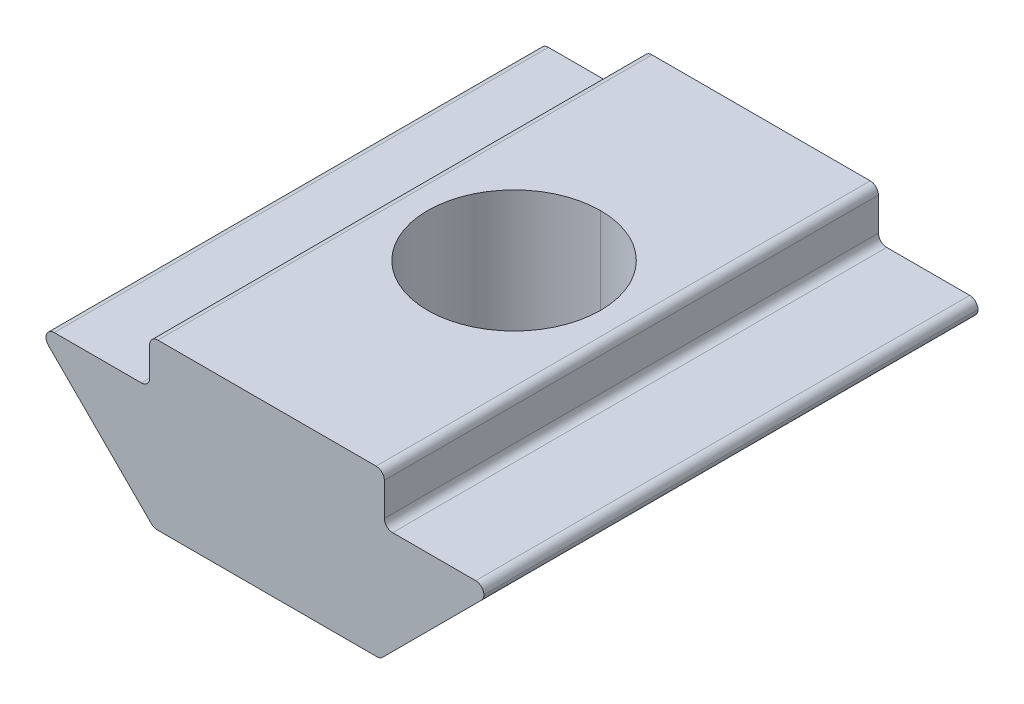
ISO-10303-21;
HEADER;
FILE_DESCRIPTION(('STEP AP214'),'2;1');
FILE_NAME('part.step','',(''),(''),'','','');
FILE_SCHEMA(('AUTOMOTIVE_DESIGN { 1 0 10303 214 1 1 1 1 }'));
ENDSEC;
DATA;
#1=APPLICATION_CONTEXT('core data for automotive mechanical design processes');
#2=APPLICATION_PROTOCOL_DEFINITION('international standard','automotive_design',2000,#1);
#3=PRODUCT_CONTEXT('',#1,'mechanical');
#4=PRODUCT('Part','Part','',(#3));
#5=PRODUCT_RELATED_PRODUCT_CATEGORY('part','',(#4));
#6=PRODUCT_DEFINITION_FORMATION('','',#4);
#7=PRODUCT_DEFINITION_CONTEXT('part definition',#1,'design');
#8=PRODUCT_DEFINITION('design','',#6,#7);
#9=PRODUCT_DEFINITION_SHAPE('','',#8);
#10=(LENGTH_UNIT() NAMED_UNIT(*) SI_UNIT(.MILLI.,.METRE.));
#11=(NAMED_UNIT(*) PLANE_ANGLE_UNIT() SI_UNIT($,.RADIAN.));
#12=(NAMED_UNIT(*) SI_UNIT($,.STERADIAN.) SOLID_ANGLE_UNIT());
#13=UNCERTAINTY_MEASURE_WITH_UNIT(LENGTH_MEASURE(1.E-05),#10,'distance_accuracy_value','');
#14=(GEOMETRIC_REPRESENTATION_CONTEXT(3) GLOBAL_UNCERTAINTY_ASSIGNED_CONTEXT((#13)) GLOBAL_UNIT_ASSIGNED_CONTEXT((#10,
#11,#12)) REPRESENTATION_CONTEXT('',''));
#15=CARTESIAN_POINT('',(0.,0.,0.));
#16=DIRECTION('',(0.,0.,1.));
#17=DIRECTION('',(1.,0.,0.));
#18=AXIS2_PLACEMENT_3D('',#15,#16,#17);
#19=CARTESIAN_POINT('',(1.90000000000005,3.00000000000005,20.));
#20=DIRECTION('',(0.,0.,1.));
#21=DIRECTION('',(1.,0.,0.));
#22=AXIS2_PLACEMENT_3D('',#19,#20,#21);
#23=CYLINDRICAL_SURFACE('',#22,0.2);
#24=CARTESIAN_POINT('',(1.90000000000005,3.00000000000005,20.));
#25=DIRECTION('',(0.,0.,-1.));
#26=DIRECTION('',(1.,0.,0.));
#27=AXIS2_PLACEMENT_3D('',#24,#25,#26);
#28=CIRCLE('',#27,0.2);
#29=CARTESIAN_POINT('',(1.90000000000005,2.80000000000005,20.));
#30=VERTEX_POINT('',#29);
#31=CARTESIAN_POINT('',(1.70000000000005,3.00000000000005,20.));
#32=VERTEX_POINT('',#31);
#33=EDGE_CURVE('E276',#30,#32,#28,.T.);
#34=ORIENTED_EDGE('',*,*,#33,.F.);
#35=DIRECTION('',(0.,0.,1.));
#36=VECTOR('',#35,1.);
#37=CARTESIAN_POINT('',(1.90000000000005,2.80000000000005,20.));
#38=LINE('',#37,#36);
#39=CARTESIAN_POINT('',(1.90000000000005,2.80000000000005,8.));
#40=VERTEX_POINT('',#39);
#41=EDGE_CURVE('E280',#40,#30,#38,.T.);
#42=ORIENTED_EDGE('',*,*,#41,.F.);
#43=CARTESIAN_POINT('',(1.90000000000005,3.00000000000005,8.));
#44=DIRECTION('',(0.,0.,1.));
#45=DIRECTION('',(1.,0.,0.));
#46=AXIS2_PLACEMENT_3D('',#43,#44,#45);
#47=CIRCLE('',#46,0.2);
#48=CARTESIAN_POINT('',(1.70000000000005,3.00000000000005,8.));
#49=VERTEX_POINT('',#48);
#50=EDGE_CURVE('E249',#49,#40,#47,.T.);
#51=ORIENTED_EDGE('',*,*,#50,.F.);
#52=DIRECTION('',(0.,0.,-1.));
#53=VECTOR('',#52,1.);
#54=CARTESIAN_POINT('',(1.70000000000005,3.00000000000005,8.));
#55=LINE('',#54,#53);
#56=EDGE_CURVE('E281',#32,#49,#55,.T.);
#57=ORIENTED_EDGE('',*,*,#56,.F.);
#58=EDGE_LOOP('',(#34,#42,#51,#57));
#59=FACE_BOUND('',#58,.T.);
#60=ADVANCED_FACE('F16',(#59),#23,.F.);
#61=CARTESIAN_POINT('',(-4.19999999999995,3.10000000000005,20.));
#62=DIRECTION('',(0.,0.,1.));
#63=DIRECTION('',(1.,0.,0.));
#64=AXIS2_PLACEMENT_3D('',#61,#62,#63);
#65=CYLINDRICAL_SURFACE('',#64,0.2);
#66=CARTESIAN_POINT('',(-4.19999999999995,3.10000000000005,20.));
#67=DIRECTION('',(0.,0.,-1.));
#68=DIRECTION('',(1.,0.,0.));
#69=AXIS2_PLACEMENT_3D('',#66,#67,#68);
#70=CIRCLE('',#69,0.2);
#71=CARTESIAN_POINT('',(-3.99999999999995,3.10000000000005,20.));
#72=VERTEX_POINT('',#71);
#73=CARTESIAN_POINT('',(-4.19999999999995,2.90000000000005,20.));
#74=VERTEX_POINT('',#73);
#75=EDGE_CURVE('E289',#72,#74,#70,.T.);
#76=ORIENTED_EDGE('',*,*,#75,.F.);
#77=DIRECTION('',(0.,0.,1.));
#78=VECTOR('',#77,1.);
#79=CARTESIAN_POINT('',(-3.99999999999995,3.10000000000005,20.));
#80=LINE('',#79,#78);
#81=CARTESIAN_POINT('',(-3.99999999999995,3.10000000000005,8.));
#82=VERTEX_POINT('',#81);
#83=EDGE_CURVE('E11',#82,#72,#80,.T.);
#84=ORIENTED_EDGE('',*,*,#83,.F.);
#85=CARTESIAN_POINT('',(-4.19999999999995,3.10000000000005,8.));
#86=DIRECTION('',(0.,0.,1.));
#87=DIRECTION('',(1.,0.,0.));
#88=AXIS2_PLACEMENT_3D('',#85,#86,#87);
#89=CIRCLE('',#88,0.2);
#90=CARTESIAN_POINT('',(-4.19999999999995,2.90000000000005,8.));
#91=VERTEX_POINT('',#90);
#92=EDGE_CURVE('E331',#91,#82,#89,.T.);
#93=ORIENTED_EDGE('',*,*,#92,.F.);
#94=DIRECTION('',(0.,0.,-1.));
#95=VECTOR('',#94,1.);
#96=CARTESIAN_POINT('',(-4.19999999999995,2.90000000000005,8.));
#97=LINE('',#96,#95);
#98=EDGE_CURVE('E20',#74,#91,#97,.T.);
#99=ORIENTED_EDGE('',*,*,#98,.F.);
#100=EDGE_LOOP('',(#76,#84,#93,#99));
#101=FACE_BOUND('',#100,.T.);
#102=ADVANCED_FACE('F488',(#101),#65,.F.);
#103=CARTESIAN_POINT('',(-3.81715728752532,0.200000000000053,8.));
#104=DIRECTION('',(0.,0.,1.));
#105=DIRECTION('',(1.,0.,0.));
#106=AXIS2_PLACEMENT_3D('',#103,#104,#105);
#107=CYLINDRICAL_SURFACE('',#106,0.2);
#108=CARTESIAN_POINT('',(-3.81715728752532,0.200000000000053,8.));
#109=DIRECTION('',(0.,0.,-1.));
#110=DIRECTION('',(1.,0.,0.));
#111=AXIS2_PLACEMENT_3D('',#108,#109,#110);
#112=CIRCLE('',#111,0.2);
#113=CARTESIAN_POINT('',(-3.81715728752532,0.,8.));
#114=VERTEX_POINT('',#113);
#115=CARTESIAN_POINT('',(-3.95857864376263,0.0585786437627442,8.));
#116=VERTEX_POINT('',#115);
#117=EDGE_CURVE('E253',#114,#116,#112,.T.);
#118=ORIENTED_EDGE('',*,*,#117,.F.);
#119=DIRECTION('',(0.,0.,-1.));
#120=VECTOR('',#119,1.);
#121=CARTESIAN_POINT('',(-3.81715728752532,0.,8.));
#122=LINE('',#121,#120);
#123=CARTESIAN_POINT('',(-3.81715728752532,0.,20.));
#124=VERTEX_POINT('',#123);
#125=EDGE_CURVE('E246',#124,#114,#122,.T.);
#126=ORIENTED_EDGE('',*,*,#125,.F.);
#127=CARTESIAN_POINT('',(-3.81715728752532,0.200000000000053,20.));
#128=DIRECTION('',(0.,0.,1.));
#129=DIRECTION('',(1.,0.,0.));
#130=AXIS2_PLACEMENT_3D('',#127,#128,#129);
#131=CIRCLE('',#130,0.2);
#132=CARTESIAN_POINT('',(-3.95857864376263,0.0585786437627442,20.));
#133=VERTEX_POINT('',#132);
#134=EDGE_CURVE('E344',#133,#124,#131,.T.);
#135=ORIENTED_EDGE('',*,*,#134,.F.);
#136=DIRECTION('',(0.,0.,1.));
#137=VECTOR('',#136,1.);
#138=CARTESIAN_POINT('',(-3.95857864376263,0.0585786437627424,8.));
#139=LINE('',#138,#137);
#140=EDGE_CURVE('E219',#116,#133,#139,.T.);
#141=ORIENTED_EDGE('',*,*,#140,.F.);
#142=EDGE_LOOP('',(#118,#126,#135,#141));
#143=FACE_BOUND('',#142,.T.);
#144=ADVANCED_FACE('F493',(#143),#107,.T.);
#145=CARTESIAN_POINT('',(-3.79999999999994,3.8,20.));
#146=DIRECTION('',(0.,0.,1.));
#147=DIRECTION('',(1.,0.,0.));
#148=AXIS2_PLACEMENT_3D('',#145,#146,#147);
#149=CYLINDRICAL_SURFACE('',#148,0.2);
#150=CARTESIAN_POINT('',(-3.79999999999994,3.8,20.));
#151=DIRECTION('',(0.,0.,1.));
#152=DIRECTION('',(1.,0.,0.));
#153=AXIS2_PLACEMENT_3D('',#150,#151,#152);
#154=CIRCLE('',#153,0.2);
#155=CARTESIAN_POINT('',(-3.79999999999994,4.,20.));
#156=VERTEX_POINT('',#155);
#157=CARTESIAN_POINT('',(-3.99999999999995,3.8,20.));
#158=VERTEX_POINT('',#157);
#159=EDGE_CURVE('E290',#156,#158,#154,.T.);
#160=ORIENTED_EDGE('',*,*,#159,.F.);
#161=DIRECTION('',(0.,0.,1.));
#162=VECTOR('',#161,1.);
#163=CARTESIAN_POINT('',(-3.79999999999994,4.,20.));
#164=LINE('',#163,#162);
#165=CARTESIAN_POINT('',(-3.79999999999994,4.,8.));
#166=VERTEX_POINT('',#165);
#167=EDGE_CURVE('E208',#166,#156,#164,.T.);
#168=ORIENTED_EDGE('',*,*,#167,.F.);
#169=CARTESIAN_POINT('',(-3.79999999999994,3.8,8.));
#170=DIRECTION('',(0.,0.,-1.));
#171=DIRECTION('',(1.,0.,0.));
#172=AXIS2_PLACEMENT_3D('',#169,#170,#171);
#173=CIRCLE('',#172,0.2);
#174=CARTESIAN_POINT('',(-3.99999999999995,3.8,8.));
#175=VERTEX_POINT('',#174);
#176=EDGE_CURVE('E197',#175,#166,#173,.T.);
#177=ORIENTED_EDGE('',*,*,#176,.F.);
#178=DIRECTION('',(0.,0.,-1.));
#179=VECTOR('',#178,1.);
#180=CARTESIAN_POINT('',(-3.99999999999995,3.8,8.));
#181=LINE('',#180,#179);
#182=EDGE_CURVE('E27',#158,#175,#181,.T.);
#183=ORIENTED_EDGE('',*,*,#182,.F.);
#184=EDGE_LOOP('',(#160,#168,#177,#183));
#185=FACE_BOUND('',#184,.T.);
#186=ADVANCED_FACE('F593',(#185),#149,.T.);
#187=CARTESIAN_POINT('',(1.50000000000005,3.80000000000005,8.));
#188=DIRECTION('',(0.,0.,1.));
#189=DIRECTION('',(1.,0.,0.));
#190=AXIS2_PLACEMENT_3D('',#187,#188,#189);
#191=CYLINDRICAL_SURFACE('',#190,0.2);
#192=CARTESIAN_POINT('',(1.50000000000005,3.80000000000005,20.));
#193=DIRECTION('',(0.,0.,1.));
#194=DIRECTION('',(1.,0.,0.));
#195=AXIS2_PLACEMENT_3D('',#192,#193,#194);
#196=CIRCLE('',#195,0.2);
#197=CARTESIAN_POINT('',(1.70000000000005,3.80000000000005,20.));
#198=VERTEX_POINT('',#197);
#199=CARTESIAN_POINT('',(1.50000000000005,4.00000000000005,20.));
#200=VERTEX_POINT('',#199);
#201=EDGE_CURVE('E275',#198,#200,#196,.T.);
#202=ORIENTED_EDGE('',*,*,#201,.F.);
#203=DIRECTION('',(0.,0.,1.));
#204=VECTOR('',#203,1.);
#205=CARTESIAN_POINT('',(1.70000000000005,3.80000000000005,20.));
#206=LINE('',#205,#204);
#207=CARTESIAN_POINT('',(1.70000000000005,3.80000000000005,8.));
#208=VERTEX_POINT('',#207);
#209=EDGE_CURVE('E191',#208,#198,#206,.T.);
#210=ORIENTED_EDGE('',*,*,#209,.F.);
#211=CARTESIAN_POINT('',(1.50000000000005,3.80000000000005,8.));
#212=DIRECTION('',(0.,0.,-1.));
#213=DIRECTION('',(1.,0.,0.));
#214=AXIS2_PLACEMENT_3D('',#211,#212,#213);
#215=CIRCLE('',#214,0.2);
#216=CARTESIAN_POINT('',(1.50000000000005,4.00000000000005,8.));
#217=VERTEX_POINT('',#216);
#218=EDGE_CURVE('E184',#217,#208,#215,.T.);
#219=ORIENTED_EDGE('',*,*,#218,.F.);
#220=DIRECTION('',(0.,0.,-1.));
#221=VECTOR('',#220,1.);
#222=CARTESIAN_POINT('',(1.50000000000005,4.00000000000005,8.));
#223=LINE('',#222,#221);
#224=EDGE_CURVE('E189',#200,#217,#223,.T.);
#225=ORIENTED_EDGE('',*,*,#224,.F.);
#226=EDGE_LOOP('',(#202,#210,#219,#225));
#227=FACE_BOUND('',#226,.T.);
#228=ADVANCED_FACE('F187',(#227),#191,.T.);
#229=CARTESIAN_POINT('',(1.51715728752543,0.200000000000053,8.));
#230=DIRECTION('',(0.,0.,1.));
#231=DIRECTION('',(1.,0.,0.));
#232=AXIS2_PLACEMENT_3D('',#229,#230,#231);
#233=CYLINDRICAL_SURFACE('',#232,0.2);
#234=CARTESIAN_POINT('',(1.51715728752543,0.200000000000053,8.));
#235=DIRECTION('',(0.,0.,-1.));
#236=DIRECTION('',(1.,0.,0.));
#237=AXIS2_PLACEMENT_3D('',#234,#235,#236);
#238=CIRCLE('',#237,0.2);
#239=CARTESIAN_POINT('',(1.65857864376274,0.0585786437627427,8.));
#240=VERTEX_POINT('',#239);
#241=CARTESIAN_POINT('',(1.51715728752543,0.,8.));
#242=VERTEX_POINT('',#241);
#243=EDGE_CURVE('E250',#240,#242,#238,.T.);
#244=ORIENTED_EDGE('',*,*,#243,.F.);
#245=DIRECTION('',(0.,0.,-1.));
#246=VECTOR('',#245,1.);
#247=CARTESIAN_POINT('',(1.65857864376274,0.0585786437627427,8.));
#248=LINE('',#247,#246);
#249=CARTESIAN_POINT('',(1.65857864376274,0.0585786437627427,20.));
#250=VERTEX_POINT('',#249);
#251=EDGE_CURVE('E229',#250,#240,#248,.T.);
#252=ORIENTED_EDGE('',*,*,#251,.F.);
#253=CARTESIAN_POINT('',(1.51715728752543,0.200000000000053,20.));
#254=DIRECTION('',(0.,0.,1.));
#255=DIRECTION('',(1.,0.,0.));
#256=AXIS2_PLACEMENT_3D('',#253,#254,#255);
#257=CIRCLE('',#256,0.2);
#258=CARTESIAN_POINT('',(1.51715728752543,0.,20.));
#259=VERTEX_POINT('',#258);
#260=EDGE_CURVE('E347',#259,#250,#257,.T.);
#261=ORIENTED_EDGE('',*,*,#260,.F.);
#262=DIRECTION('',(0.,0.,1.));
#263=VECTOR('',#262,1.);
#264=CARTESIAN_POINT('',(1.51715728752543,0.,8.));
#265=LINE('',#264,#263);
#266=EDGE_CURVE('E322',#242,#259,#265,.T.);
#267=ORIENTED_EDGE('',*,*,#266,.F.);
#268=EDGE_LOOP('',(#244,#252,#261,#267));
#269=FACE_BOUND('',#268,.T.);
#270=ADVANCED_FACE('F450',(#269),#233,.T.);
#271=CARTESIAN_POINT('',(3.91715728752544,2.60000000000005,20.));
#272=DIRECTION('',(0.,0.,1.));
#273=DIRECTION('',(1.,0.,0.));
#274=AXIS2_PLACEMENT_3D('',#271,#272,#273);
#275=CYLINDRICAL_SURFACE('',#274,0.2);
#276=DIRECTION('',(0.,0.,1.));
#277=VECTOR('',#276,1.);
#278=CARTESIAN_POINT('',(4.11715728752544,2.60000000000005,20.));
#279=LINE('',#278,#277);
#280=CARTESIAN_POINT('',(4.11715728752544,2.60000000000005,8.));
#281=VERTEX_POINT('',#280);
#282=CARTESIAN_POINT('',(4.11715728752544,2.60000000000005,20.));
#283=VERTEX_POINT('',#282);
#284=EDGE_CURVE('E343',#281,#283,#279,.T.);
#285=ORIENTED_EDGE('',*,*,#284,.F.);
#286=CARTESIAN_POINT('',(3.91715728752544,2.60000000000005,8.));
#287=DIRECTION('',(0.,0.,-1.));
#288=DIRECTION('',(1.,0.,0.));
#289=AXIS2_PLACEMENT_3D('',#286,#287,#288);
#290=CIRCLE('',#289,0.2);
#291=CARTESIAN_POINT('',(3.91715728752544,2.80000000000005,8.));
#292=VERTEX_POINT('',#291);
#293=EDGE_CURVE('E254',#292,#281,#290,.T.);
#294=ORIENTED_EDGE('',*,*,#293,.F.);
#295=DIRECTION('',(0.,0.,-1.));
#296=VECTOR('',#295,1.);
#297=CARTESIAN_POINT('',(3.91715728752544,2.80000000000005,8.));
#298=LINE('',#297,#296);
#299=CARTESIAN_POINT('',(3.91715728752544,2.80000000000005,20.));
#300=VERTEX_POINT('',#299);
#301=EDGE_CURVE('E277',#300,#292,#298,.T.);
#302=ORIENTED_EDGE('',*,*,#301,.F.);
#303=CARTESIAN_POINT('',(3.91715728752544,2.60000000000005,20.));
#304=DIRECTION('',(0.,0.,1.));
#305=DIRECTION('',(1.,0.,0.));
#306=AXIS2_PLACEMENT_3D('',#303,#304,#305);
#307=CIRCLE('',#306,0.2);
#308=EDGE_CURVE('E317',#283,#300,#307,.T.);
#309=ORIENTED_EDGE('',*,*,#308,.F.);
#310=EDGE_LOOP('',(#285,#294,#302,#309));
#311=FACE_BOUND('',#310,.T.);
#312=ADVANCED_FACE('F608',(#311),#275,.T.);
#313=CARTESIAN_POINT('',(-6.3171572875253,2.70000000000005,20.));
#314=DIRECTION('',(0.,0.,-1.));
#315=DIRECTION('',(-1.,0.,0.));
#316=AXIS2_PLACEMENT_3D('',#313,#314,#315);
#317=CYLINDRICAL_SURFACE('',#316,0.2);
#318=DIRECTION('',(0.,0.,-1.));
#319=VECTOR('',#318,1.);
#320=CARTESIAN_POINT('',(-6.5171572875253,2.70000000000005,20.));
#321=LINE('',#320,#319);
#322=CARTESIAN_POINT('',(-6.5171572875253,2.70000000000005,20.));
#323=VERTEX_POINT('',#322);
#324=CARTESIAN_POINT('',(-6.5171572875253,2.70000000000005,8.));
#325=VERTEX_POINT('',#324);
#326=EDGE_CURVE('E306',#323,#325,#321,.T.);
#327=ORIENTED_EDGE('',*,*,#326,.F.);
#328=CARTESIAN_POINT('',(-6.3171572875253,2.70000000000005,20.));
#329=DIRECTION('',(0.,0.,1.));
#330=DIRECTION('',(1.,0.,0.));
#331=AXIS2_PLACEMENT_3D('',#328,#329,#330);
#332=CIRCLE('',#331,0.2);
#333=CARTESIAN_POINT('',(-6.31715728752531,2.90000000000004,20.));
#334=VERTEX_POINT('',#333);
#335=EDGE_CURVE('E270',#334,#323,#332,.T.);
#336=ORIENTED_EDGE('',*,*,#335,.F.);
#337=DIRECTION('',(0.,0.,1.));
#338=VECTOR('',#337,1.);
#339=CARTESIAN_POINT('',(-6.31715728752531,2.90000000000004,20.));
#340=LINE('',#339,#338);
#341=CARTESIAN_POINT('',(-6.31715728752531,2.90000000000004,8.));
#342=VERTEX_POINT('',#341);
#343=EDGE_CURVE('E301',#342,#334,#340,.T.);
#344=ORIENTED_EDGE('',*,*,#343,.F.);
#345=CARTESIAN_POINT('',(-6.3171572875253,2.70000000000005,8.));
#346=DIRECTION('',(0.,0.,-1.));
#347=DIRECTION('',(1.,0.,0.));
#348=AXIS2_PLACEMENT_3D('',#345,#346,#347);
#349=CIRCLE('',#348,0.2);
#350=EDGE_CURVE('E245',#325,#342,#349,.T.);
#351=ORIENTED_EDGE('',*,*,#350,.F.);
#352=EDGE_LOOP('',(#327,#336,#344,#351));
#353=FACE_BOUND('',#352,.T.);
#354=ADVANCED_FACE('F537',(#353),#317,.T.);
#355=CARTESIAN_POINT('',(-1.14999999999995,0.,14.));
#356=DIRECTION('',(0.,-1.,0.));
#357=DIRECTION('',(0.,0.,-1.));
#358=AXIS2_PLACEMENT_3D('',#355,#356,#357);
#359=CYLINDRICAL_SURFACE('',#358,2.1);
#360=DIRECTION('',(0.,-1.,0.));
#361=VECTOR('',#360,1.);
#362=CARTESIAN_POINT('',(-1.14999999999994,0.,16.1));
#363=LINE('',#362,#361);
#364=CARTESIAN_POINT('',(-1.14999999999994,4.,16.1));
#365=VERTEX_POINT('',#364);
#366=CARTESIAN_POINT('',(-1.14999999999994,0.,16.1));
#367=VERTEX_POINT('',#366);
#368=EDGE_CURVE('E377',#365,#367,#363,.T.);
#369=ORIENTED_EDGE('',*,*,#368,.F.);
#370=CARTESIAN_POINT('',(-1.14999999999995,4.,14.));
#371=DIRECTION('',(0.,-1.,0.));
#372=DIRECTION('',(0.,0.,-1.));
#373=AXIS2_PLACEMENT_3D('',#370,#371,#372);
#374=CIRCLE('',#373,2.1);
#375=CARTESIAN_POINT('',(-1.14999999999995,4.,11.9));
#376=VERTEX_POINT('',#375);
#377=EDGE_CURVE('E305',#376,#365,#374,.T.);
#378=ORIENTED_EDGE('',*,*,#377,.F.);
#379=DIRECTION('',(0.,-1.,0.));
#380=VECTOR('',#379,1.);
#381=CARTESIAN_POINT('',(-1.14999999999995,0.,11.9));
#382=LINE('',#381,#380);
#383=CARTESIAN_POINT('',(-1.14999999999995,0.,11.9));
#384=VERTEX_POINT('',#383);
#385=EDGE_CURVE('E282',#376,#384,#382,.T.);
#386=ORIENTED_EDGE('',*,*,#385,.T.);
#387=CARTESIAN_POINT('',(-1.14999999999995,0.,14.));
#388=DIRECTION('',(0.,-1.,0.));
#389=DIRECTION('',(0.,0.,-1.));
#390=AXIS2_PLACEMENT_3D('',#387,#388,#389);
#391=CIRCLE('',#390,2.1);
#392=EDGE_CURVE('E242',#384,#367,#391,.T.);
#393=ORIENTED_EDGE('',*,*,#392,.T.);
#394=EDGE_LOOP('',(#369,#378,#386,#393));
#395=FACE_BOUND('',#394,.T.);
#396=ADVANCED_FACE('F533',(#395),#359,.F.);
#397=CARTESIAN_POINT('',(-3.99999999999995,4.00000000000005,20.));
#398=DIRECTION('',(1.,0.,0.));
#399=DIRECTION('',(0.,1.,0.));
#400=AXIS2_PLACEMENT_3D('',#397,#398,#399);
#401=PLANE('',#400);
#402=DIRECTION('',(0.,-1.,0.));
#403=VECTOR('',#402,1.);
#404=CARTESIAN_POINT('',(-3.99999999999995,4.00000000000005,20.));
#405=LINE('',#404,#403);
#406=EDGE_CURVE('E286',#158,#72,#405,.T.);
#407=ORIENTED_EDGE('',*,*,#406,.F.);
#408=ORIENTED_EDGE('',*,*,#182,.T.);
#409=DIRECTION('',(0.,-1.,0.));
#410=VECTOR('',#409,1.);
#411=CARTESIAN_POINT('',(-3.99999999999995,4.00000000000005,8.));
#412=LINE('',#411,#410);
#413=EDGE_CURVE('E329',#175,#82,#412,.T.);
#414=ORIENTED_EDGE('',*,*,#413,.T.);
#415=ORIENTED_EDGE('',*,*,#83,.T.);
#416=EDGE_LOOP('',(#407,#408,#414,#415));
#417=FACE_BOUND('',#416,.T.);
#418=ADVANCED_FACE('F506',(#417),#401,.F.);
#419=CARTESIAN_POINT('',(-3.99999999999995,2.90000000000005,20.));
#420=DIRECTION('',(0.,-1.,0.));
#421=DIRECTION('',(0.,0.,-1.));
#422=AXIS2_PLACEMENT_3D('',#419,#420,#421);
#423=PLANE('',#422);
#424=DIRECTION('',(-1.,0.,0.));
#425=VECTOR('',#424,1.);
#426=CARTESIAN_POINT('',(-3.99999999999995,2.90000000000005,8.));
#427=LINE('',#426,#425);
#428=EDGE_CURVE('E336',#91,#342,#427,.T.);
#429=ORIENTED_EDGE('',*,*,#428,.T.);
#430=ORIENTED_EDGE('',*,*,#343,.T.);
#431=DIRECTION('',(-1.,0.,0.));
#432=VECTOR('',#431,1.);
#433=CARTESIAN_POINT('',(-3.99999999999995,2.90000000000005,20.));
#434=LINE('',#433,#432);
#435=EDGE_CURVE('E266',#74,#334,#434,.T.);
#436=ORIENTED_EDGE('',*,*,#435,.F.);
#437=ORIENTED_EDGE('',*,*,#98,.T.);
#438=EDGE_LOOP('',(#429,#430,#436,#437));
#439=FACE_BOUND('',#438,.T.);
#440=ADVANCED_FACE('F500',(#439),#423,.F.);
#441=CARTESIAN_POINT('',(4.60000000000006,2.80000000000005,20.));
#442=DIRECTION('',(0.,-1.,0.));
#443=DIRECTION('',(0.,0.,-1.));
#444=AXIS2_PLACEMENT_3D('',#441,#442,#443);
#445=PLANE('',#444);
#446=DIRECTION('',(1.,0.,0.));
#447=VECTOR('',#446,1.);
#448=CARTESIAN_POINT('',(0.,2.80000000000005,20.));
#449=LINE('',#448,#447);
#450=EDGE_CURVE('E298',#30,#300,#449,.T.);
#451=ORIENTED_EDGE('',*,*,#450,.T.);
#452=ORIENTED_EDGE('',*,*,#301,.T.);
#453=DIRECTION('',(-1.,0.,0.));
#454=VECTOR('',#453,1.);
#455=CARTESIAN_POINT('',(4.60000000000006,2.80000000000005,8.));
#456=LINE('',#455,#454);
#457=EDGE_CURVE('E257',#292,#40,#456,.T.);
#458=ORIENTED_EDGE('',*,*,#457,.T.);
#459=ORIENTED_EDGE('',*,*,#41,.T.);
#460=EDGE_LOOP('',(#451,#452,#458,#459));
#461=FACE_BOUND('',#460,.T.);
#462=ADVANCED_FACE('F505',(#461),#445,.F.);
#463=CARTESIAN_POINT('',(1.70000000000005,2.80000000000005,20.));
#464=DIRECTION('',(-1.,0.,0.));
#465=DIRECTION('',(0.,0.,1.));
#466=AXIS2_PLACEMENT_3D('',#463,#464,#465);
#467=PLANE('',#466);
#468=DIRECTION('',(0.,1.,0.));
#469=VECTOR('',#468,1.);
#470=CARTESIAN_POINT('',(1.70000000000005,2.80000000000005,8.));
#471=LINE('',#470,#469);
#472=EDGE_CURVE('E196',#49,#208,#471,.T.);
#473=ORIENTED_EDGE('',*,*,#472,.T.);
#474=ORIENTED_EDGE('',*,*,#209,.T.);
#475=DIRECTION('',(0.,1.,0.));
#476=VECTOR('',#475,1.);
#477=CARTESIAN_POINT('',(1.70000000000005,2.80000000000005,20.));
#478=LINE('',#477,#476);
#479=EDGE_CURVE('E271',#32,#198,#478,.T.);
#480=ORIENTED_EDGE('',*,*,#479,.F.);
#481=ORIENTED_EDGE('',*,*,#56,.T.);
#482=EDGE_LOOP('',(#473,#474,#480,#481));
#483=FACE_BOUND('',#482,.T.);
#484=ADVANCED_FACE('F517',(#483),#467,.F.);
#485=CARTESIAN_POINT('',(0.,0.,20.));
#486=DIRECTION('',(0.,0.,1.));
#487=DIRECTION('',(1.,0.,0.));
#488=AXIS2_PLACEMENT_3D('',#485,#486,#487);
#489=PLANE('',#488);
#490=ORIENTED_EDGE('',*,*,#435,.T.);
#491=ORIENTED_EDGE('',*,*,#335,.T.);
#492=CARTESIAN_POINT('',(-6.3171572875253,2.70000000000005,20.));
#493=DIRECTION('',(0.,0.,1.));
#494=DIRECTION('',(1.,0.,0.));
#495=AXIS2_PLACEMENT_3D('',#492,#493,#494);
#496=CIRCLE('',#495,0.2);
#497=CARTESIAN_POINT('',(-6.45857864376261,2.55857864376273,20.));
#498=VERTEX_POINT('',#497);
#499=EDGE_CURVE('E240',#323,#498,#496,.T.);
#500=ORIENTED_EDGE('',*,*,#499,.T.);
#501=DIRECTION('',(0.707106781186547,-0.707106781186549,0.));
#502=VECTOR('',#501,1.);
#503=CARTESIAN_POINT('',(-6.9,3.00000000000007,20.));
#504=LINE('',#503,#502);
#505=EDGE_CURVE('E235',#498,#133,#504,.T.);
#506=ORIENTED_EDGE('',*,*,#505,.T.);
#507=ORIENTED_EDGE('',*,*,#134,.T.);
#508=DIRECTION('',(1.,0.,0.));
#509=VECTOR('',#508,1.);
#510=CARTESIAN_POINT('',(-3.89999999999994,0.,20.));
#511=LINE('',#510,#509);
#512=EDGE_CURVE('E318',#124,#259,#511,.T.);
#513=ORIENTED_EDGE('',*,*,#512,.T.);
#514=ORIENTED_EDGE('',*,*,#260,.T.);
#515=DIRECTION('',(0.707106781186549,0.707106781186546,0.));
#516=VECTOR('',#515,1.);
#517=CARTESIAN_POINT('',(1.60000000000006,0.,20.));
#518=LINE('',#517,#516);
#519=CARTESIAN_POINT('',(4.05857864376275,2.45857864376274,20.));
#520=VERTEX_POINT('',#519);
#521=EDGE_CURVE('E225',#250,#520,#518,.T.);
#522=ORIENTED_EDGE('',*,*,#521,.T.);
#523=CARTESIAN_POINT('',(3.91715728752544,2.60000000000005,20.));
#524=DIRECTION('',(0.,0.,1.));
#525=DIRECTION('',(1.,0.,0.));
#526=AXIS2_PLACEMENT_3D('',#523,#524,#525);
#527=CIRCLE('',#526,0.2);
#528=EDGE_CURVE('E241',#520,#283,#527,.T.);
#529=ORIENTED_EDGE('',*,*,#528,.T.);
#530=ORIENTED_EDGE('',*,*,#308,.T.);
#531=ORIENTED_EDGE('',*,*,#450,.F.);
#532=ORIENTED_EDGE('',*,*,#33,.T.);
#533=ORIENTED_EDGE('',*,*,#479,.T.);
#534=ORIENTED_EDGE('',*,*,#201,.T.);
#535=DIRECTION('',(-1.,0.,0.));
#536=VECTOR('',#535,1.);
#537=CARTESIAN_POINT('',(4.60000000000006,4.00000000000005,20.));
#538=LINE('',#537,#536);
#539=EDGE_CURVE('E212',#200,#156,#538,.T.);
#540=ORIENTED_EDGE('',*,*,#539,.T.);
#541=ORIENTED_EDGE('',*,*,#159,.T.);
#542=ORIENTED_EDGE('',*,*,#406,.T.);
#543=ORIENTED_EDGE('',*,*,#75,.T.);
#544=EDGE_LOOP('',(#490,#491,#500,#506,#507,#513,#514,#522,#529,#530,#531,#532,#533,#534,#540,
#541,#542,#543));
#545=FACE_BOUND('',#544,.T.);
#546=ADVANCED_FACE('F418',(#545),#489,.T.);
#547=CARTESIAN_POINT('',(0.,0.,8.));
#548=DIRECTION('',(0.,0.,1.));
#549=DIRECTION('',(1.,0.,0.));
#550=AXIS2_PLACEMENT_3D('',#547,#548,#549);
#551=PLANE('',#550);
#552=DIRECTION('',(0.707106781186547,-0.707106781186549,0.));
#553=VECTOR('',#552,1.);
#554=CARTESIAN_POINT('',(-6.9,3.00000000000007,8.));
#555=LINE('',#554,#553);
#556=CARTESIAN_POINT('',(-6.45857864376261,2.55857864376273,8.));
#557=VERTEX_POINT('',#556);
#558=EDGE_CURVE('E231',#557,#116,#555,.T.);
#559=ORIENTED_EDGE('',*,*,#558,.F.);
#560=CARTESIAN_POINT('',(-6.3171572875253,2.70000000000005,8.));
#561=DIRECTION('',(0.,0.,-1.));
#562=DIRECTION('',(1.,0.,0.));
#563=AXIS2_PLACEMENT_3D('',#560,#561,#562);
#564=CIRCLE('',#563,0.2);
#565=EDGE_CURVE('E265',#557,#325,#564,.T.);
#566=ORIENTED_EDGE('',*,*,#565,.T.);
#567=ORIENTED_EDGE('',*,*,#350,.T.);
#568=ORIENTED_EDGE('',*,*,#428,.F.);
#569=ORIENTED_EDGE('',*,*,#92,.T.);
#570=ORIENTED_EDGE('',*,*,#413,.F.);
#571=ORIENTED_EDGE('',*,*,#176,.T.);
#572=DIRECTION('',(-1.,0.,0.));
#573=VECTOR('',#572,1.);
#574=CARTESIAN_POINT('',(4.60000000000006,4.00000000000005,8.));
#575=LINE('',#574,#573);
#576=EDGE_CURVE('E200',#217,#166,#575,.T.);
#577=ORIENTED_EDGE('',*,*,#576,.F.);
#578=ORIENTED_EDGE('',*,*,#218,.T.);
#579=ORIENTED_EDGE('',*,*,#472,.F.);
#580=ORIENTED_EDGE('',*,*,#50,.T.);
#581=ORIENTED_EDGE('',*,*,#457,.F.);
#582=ORIENTED_EDGE('',*,*,#293,.T.);
#583=CARTESIAN_POINT('',(3.91715728752544,2.60000000000005,8.));
#584=DIRECTION('',(0.,0.,-1.));
#585=DIRECTION('',(1.,0.,0.));
#586=AXIS2_PLACEMENT_3D('',#583,#584,#585);
#587=CIRCLE('',#586,0.2);
#588=CARTESIAN_POINT('',(4.05857864376275,2.45857864376274,8.));
#589=VERTEX_POINT('',#588);
#590=EDGE_CURVE('E353',#281,#589,#587,.T.);
#591=ORIENTED_EDGE('',*,*,#590,.T.);
#592=DIRECTION('',(0.707106781186549,0.707106781186546,0.));
#593=VECTOR('',#592,1.);
#594=CARTESIAN_POINT('',(1.60000000000006,0.,8.));
#595=LINE('',#594,#593);
#596=EDGE_CURVE('E230',#240,#589,#595,.T.);
#597=ORIENTED_EDGE('',*,*,#596,.F.);
#598=ORIENTED_EDGE('',*,*,#243,.T.);
#599=DIRECTION('',(1.,0.,0.));
#600=VECTOR('',#599,1.);
#601=CARTESIAN_POINT('',(-3.89999999999994,0.,8.));
#602=LINE('',#601,#600);
#603=EDGE_CURVE('E313',#114,#242,#602,.T.);
#604=ORIENTED_EDGE('',*,*,#603,.F.);
#605=ORIENTED_EDGE('',*,*,#117,.T.);
#606=EDGE_LOOP('',(#559,#566,#567,#568,#569,#570,#571,#577,#578,#579,#580,#581,#582,#591,#597,
#598,#604,#605));
#607=FACE_BOUND('',#606,.T.);
#608=ADVANCED_FACE('F201',(#607),#551,.F.);
#609=CARTESIAN_POINT('',(-3.89999999999994,0.,8.));
#610=DIRECTION('',(0.,-1.,0.));
#611=DIRECTION('',(0.,0.,-1.));
#612=AXIS2_PLACEMENT_3D('',#609,#610,#611);
#613=PLANE('',#612);
#614=ORIENTED_EDGE('',*,*,#392,.F.);
#615=CARTESIAN_POINT('',(-1.14999999999995,0.,14.));
#616=DIRECTION('',(0.,-1.,0.));
#617=DIRECTION('',(0.,0.,-1.));
#618=AXIS2_PLACEMENT_3D('',#615,#616,#617);
#619=CIRCLE('',#618,2.1);
#620=EDGE_CURVE('E223',#367,#384,#619,.T.);
#621=ORIENTED_EDGE('',*,*,#620,.F.);
#622=EDGE_LOOP('',(#614,#621));
#623=FACE_BOUND('',#622,.T.);
#624=ORIENTED_EDGE('',*,*,#603,.T.);
#625=ORIENTED_EDGE('',*,*,#266,.T.);
#626=ORIENTED_EDGE('',*,*,#512,.F.);
#627=ORIENTED_EDGE('',*,*,#125,.T.);
#628=EDGE_LOOP('',(#624,#625,#626,#627));
#629=FACE_BOUND('',#628,.T.);
#630=ADVANCED_FACE('F442',(#623,#629),#613,.T.);
#631=CARTESIAN_POINT('',(1.60000000000006,0.,8.));
#632=DIRECTION('',(0.707106781186546,-0.707106781186549,0.));
#633=DIRECTION('',(0.,0.,-1.));
#634=AXIS2_PLACEMENT_3D('',#631,#632,#633);
#635=PLANE('',#634);
#636=ORIENTED_EDGE('',*,*,#596,.T.);
#637=DIRECTION('',(0.,0.,1.));
#638=VECTOR('',#637,1.);
#639=CARTESIAN_POINT('',(4.05857864376275,2.45857864376274,20.));
#640=LINE('',#639,#638);
#641=EDGE_CURVE('E236',#589,#520,#640,.T.);
#642=ORIENTED_EDGE('',*,*,#641,.T.);
#643=ORIENTED_EDGE('',*,*,#521,.F.);
#644=ORIENTED_EDGE('',*,*,#251,.T.);
#645=EDGE_LOOP('',(#636,#642,#643,#644));
#646=FACE_BOUND('',#645,.T.);
#647=ADVANCED_FACE('F18',(#646),#635,.T.);
#648=CARTESIAN_POINT('',(4.60000000000006,4.00000000000005,8.));
#649=DIRECTION('',(0.,1.,0.));
#650=DIRECTION('',(1.,0.,0.));
#651=AXIS2_PLACEMENT_3D('',#648,#649,#650);
#652=PLANE('',#651);
#653=ORIENTED_EDGE('',*,*,#377,.T.);
#654=CARTESIAN_POINT('',(-1.14999999999995,4.,14.));
#655=DIRECTION('',(0.,-1.,0.));
#656=DIRECTION('',(0.,0.,-1.));
#657=AXIS2_PLACEMENT_3D('',#654,#655,#656);
#658=CIRCLE('',#657,2.1);
#659=EDGE_CURVE('E264',#365,#376,#658,.T.);
#660=ORIENTED_EDGE('',*,*,#659,.T.);
#661=EDGE_LOOP('',(#653,#660));
#662=FACE_BOUND('',#661,.T.);
#663=ORIENTED_EDGE('',*,*,#539,.F.);
#664=ORIENTED_EDGE('',*,*,#224,.T.);
#665=ORIENTED_EDGE('',*,*,#576,.T.);
#666=ORIENTED_EDGE('',*,*,#167,.T.);
#667=EDGE_LOOP('',(#663,#664,#665,#666));
#668=FACE_BOUND('',#667,.T.);
#669=ADVANCED_FACE('F210',(#662,#668),#652,.T.);
#670=CARTESIAN_POINT('',(-6.9,3.00000000000007,8.));
#671=DIRECTION('',(-0.707106781186549,-0.707106781186547,0.));
#672=DIRECTION('',(-0.707106781186547,0.707106781186549,0.));
#673=AXIS2_PLACEMENT_3D('',#670,#671,#672);
#674=PLANE('',#673);
#675=ORIENTED_EDGE('',*,*,#505,.F.);
#676=DIRECTION('',(0.,0.,-1.));
#677=VECTOR('',#676,1.);
#678=CARTESIAN_POINT('',(-6.45857864376261,2.55857864376273,8.));
#679=LINE('',#678,#677);
#680=EDGE_CURVE('E260',#498,#557,#679,.T.);
#681=ORIENTED_EDGE('',*,*,#680,.T.);
#682=ORIENTED_EDGE('',*,*,#558,.T.);
#683=ORIENTED_EDGE('',*,*,#140,.T.);
#684=EDGE_LOOP('',(#675,#681,#682,#683));
#685=FACE_BOUND('',#684,.T.);
#686=ADVANCED_FACE('F413',(#685),#674,.T.);
#687=CARTESIAN_POINT('',(-1.14999999999995,0.,14.));
#688=DIRECTION('',(0.,-1.,0.));
#689=DIRECTION('',(0.,0.,-1.));
#690=AXIS2_PLACEMENT_3D('',#687,#688,#689);
#691=CYLINDRICAL_SURFACE('',#690,2.1);
#692=ORIENTED_EDGE('',*,*,#659,.F.);
#693=ORIENTED_EDGE('',*,*,#368,.T.);
#694=ORIENTED_EDGE('',*,*,#620,.T.);
#695=ORIENTED_EDGE('',*,*,#385,.F.);
#696=EDGE_LOOP('',(#692,#693,#694,#695));
#697=FACE_BOUND('',#696,.T.);
#698=ADVANCED_FACE('F560',(#697),#691,.F.);
#699=CARTESIAN_POINT('',(-6.3171572875253,2.70000000000005,20.));
#700=DIRECTION('',(0.,0.,-1.));
#701=DIRECTION('',(-1.,0.,0.));
#702=AXIS2_PLACEMENT_3D('',#699,#700,#701);
#703=CYLINDRICAL_SURFACE('',#702,0.2);
#704=ORIENTED_EDGE('',*,*,#499,.F.);
#705=ORIENTED_EDGE('',*,*,#326,.T.);
#706=ORIENTED_EDGE('',*,*,#565,.F.);
#707=ORIENTED_EDGE('',*,*,#680,.F.);
#708=EDGE_LOOP('',(#704,#705,#706,#707));
#709=FACE_BOUND('',#708,.T.);
#710=ADVANCED_FACE('F553',(#709),#703,.T.);
#711=CARTESIAN_POINT('',(3.91715728752544,2.60000000000005,20.));
#712=DIRECTION('',(0.,0.,1.));
#713=DIRECTION('',(1.,0.,0.));
#714=AXIS2_PLACEMENT_3D('',#711,#712,#713);
#715=CYLINDRICAL_SURFACE('',#714,0.2);
#716=ORIENTED_EDGE('',*,*,#590,.F.);
#717=ORIENTED_EDGE('',*,*,#284,.T.);
#718=ORIENTED_EDGE('',*,*,#528,.F.);
#719=ORIENTED_EDGE('',*,*,#641,.F.);
#720=EDGE_LOOP('',(#716,#717,#718,#719));
#721=FACE_BOUND('',#720,.T.);
#722=ADVANCED_FACE('F548',(#721),#715,.T.);
#723=CLOSED_SHELL('',(#60,#102,#144,#186,#228,#270,#312,#354,#396,#418,#440,#462,#484,#546,#608,
#630,#647,#669,#686,#698,#710,#722));
#724=MANIFOLD_SOLID_BREP('B1',#723);
#725=ADVANCED_BREP_SHAPE_REPRESENTATION('',(#18,#724),#14);
#726=SHAPE_DEFINITION_REPRESENTATION(#9,#725);
ENDSEC;
END-ISO-10303-21;
